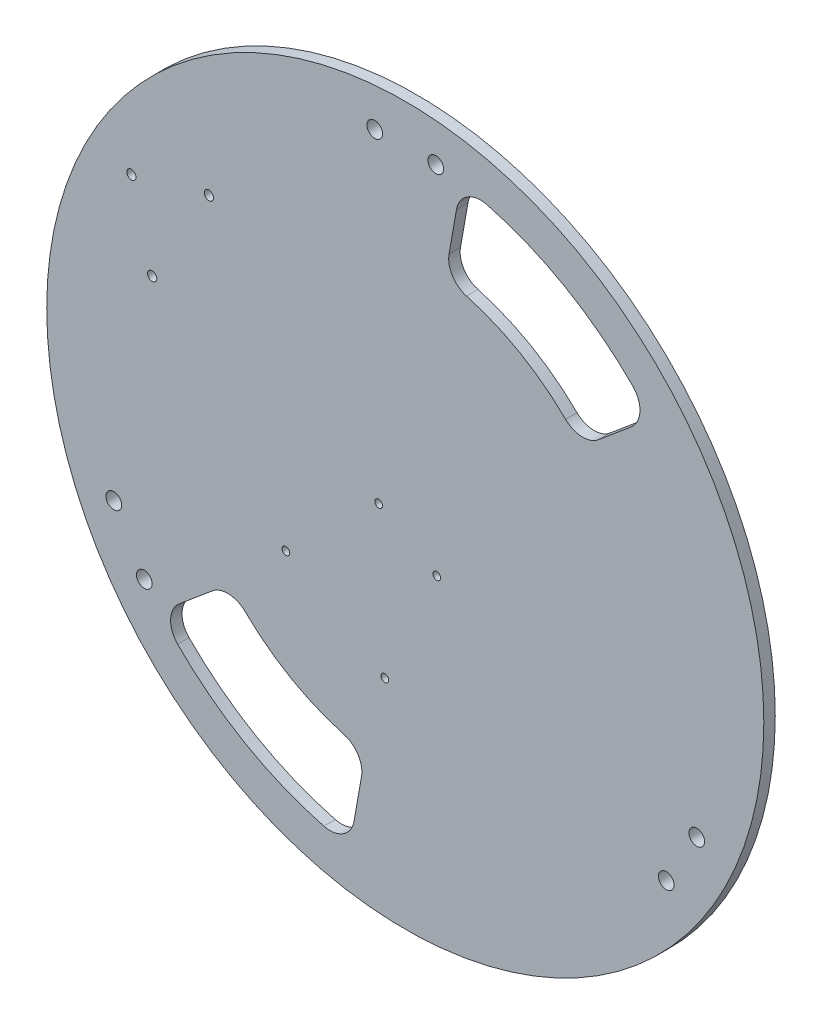
ISO-10303-21;
HEADER;
FILE_DESCRIPTION(('STEP AP214'),'2;1');
FILE_NAME('part.step','',(''),(''),'','','');
FILE_SCHEMA(('AUTOMOTIVE_DESIGN { 1 0 10303 214 1 1 1 1 }'));
ENDSEC;
DATA;
#1=APPLICATION_CONTEXT('core data for automotive mechanical design processes');
#2=APPLICATION_PROTOCOL_DEFINITION('international standard','automotive_design',2000,#1);
#3=PRODUCT_CONTEXT('',#1,'mechanical');
#4=PRODUCT('Part','Part','',(#3));
#5=PRODUCT_RELATED_PRODUCT_CATEGORY('part','',(#4));
#6=PRODUCT_DEFINITION_FORMATION('','',#4);
#7=PRODUCT_DEFINITION_CONTEXT('part definition',#1,'design');
#8=PRODUCT_DEFINITION('design','',#6,#7);
#9=PRODUCT_DEFINITION_SHAPE('','',#8);
#10=(LENGTH_UNIT() NAMED_UNIT(*) SI_UNIT(.MILLI.,.METRE.));
#11=(NAMED_UNIT(*) PLANE_ANGLE_UNIT() SI_UNIT($,.RADIAN.));
#12=(NAMED_UNIT(*) SI_UNIT($,.STERADIAN.) SOLID_ANGLE_UNIT());
#13=UNCERTAINTY_MEASURE_WITH_UNIT(LENGTH_MEASURE(1.E-05),#10,'distance_accuracy_value','');
#14=(GEOMETRIC_REPRESENTATION_CONTEXT(3) GLOBAL_UNCERTAINTY_ASSIGNED_CONTEXT((#13)) GLOBAL_UNIT_ASSIGNED_CONTEXT((#10,
#11,#12)) REPRESENTATION_CONTEXT('',''));
#15=CARTESIAN_POINT('',(0.,0.,0.));
#16=DIRECTION('',(0.,0.,1.));
#17=DIRECTION('',(1.,0.,0.));
#18=AXIS2_PLACEMENT_3D('',#15,#16,#17);
#19=CARTESIAN_POINT('',(0.,0.,4.762));
#20=DIRECTION('',(0.,0.,-1.));
#21=DIRECTION('',(-1.,0.,0.));
#22=AXIS2_PLACEMENT_3D('',#19,#20,#21);
#23=CYLINDRICAL_SURFACE('',#22,149.225);
#24=CARTESIAN_POINT('',(0.,0.,4.762));
#25=DIRECTION('',(0.,0.,1.));
#26=DIRECTION('',(1.,0.,0.));
#27=AXIS2_PLACEMENT_3D('',#24,#25,#26);
#28=CIRCLE('',#27,149.225);
#29=CARTESIAN_POINT('',(149.225,0.,4.762));
#30=VERTEX_POINT('',#29);
#31=EDGE_CURVE('E12',#30,#30,#28,.T.);
#32=ORIENTED_EDGE('',*,*,#31,.F.);
#33=EDGE_LOOP('',(#32));
#34=FACE_BOUND('',#33,.T.);
#35=CARTESIAN_POINT('',(0.,0.,0.));
#36=DIRECTION('',(0.,0.,1.));
#37=DIRECTION('',(1.,0.,0.));
#38=AXIS2_PLACEMENT_3D('',#35,#36,#37);
#39=CIRCLE('',#38,149.225);
#40=CARTESIAN_POINT('',(149.225,0.,0.));
#41=VERTEX_POINT('',#40);
#42=EDGE_CURVE('E47',#41,#41,#39,.T.);
#43=ORIENTED_EDGE('',*,*,#42,.T.);
#44=EDGE_LOOP('',(#43));
#45=FACE_BOUND('',#44,.T.);
#46=ADVANCED_FACE('F44',(#34,#45),#23,.T.);
#47=CARTESIAN_POINT('',(0.,0.,4.762));
#48=DIRECTION('',(0.,0.,1.));
#49=DIRECTION('',(1.,0.,0.));
#50=AXIS2_PLACEMENT_3D('',#47,#48,#49);
#51=PLANE('',#50);
#52=CARTESIAN_POINT('',(-73.8420625200768,-75.2237854855835,4.762));
#53=DIRECTION('',(0.,0.,1.));
#54=DIRECTION('',(-1.,0.,0.));
#55=AXIS2_PLACEMENT_3D('',#52,#53,#54);
#56=CIRCLE('',#55,10.16);
#57=CARTESIAN_POINT('',(-66.724755289226,-67.9733001375755,4.762));
#58=VERTEX_POINT('',#57);
#59=CARTESIAN_POINT('',(-80.3727846344921,-67.4407739434947,4.762));
#60=VERTEX_POINT('',#59);
#61=EDGE_CURVE('E59',#58,#60,#56,.T.);
#62=ORIENTED_EDGE('',*,*,#61,.F.);
#63=CARTESIAN_POINT('',(0.,0.,4.762));
#64=DIRECTION('',(0.,0.,-1.));
#65=DIRECTION('',(-1.,0.,0.));
#66=AXIS2_PLACEMENT_3D('',#63,#64,#65);
#67=CIRCLE('',#66,95.25);
#68=CARTESIAN_POINT('',(-25.5042270535908,-91.7719832105577,4.762));
#69=VERTEX_POINT('',#68);
#70=EDGE_CURVE('E176',#69,#58,#67,.T.);
#71=ORIENTED_EDGE('',*,*,#70,.F.);
#72=CARTESIAN_POINT('',(-28.2246779393071,-101.560994753017,4.762));
#73=DIRECTION('',(0.,0.,1.));
#74=DIRECTION('',(1.,0.,0.));
#75=AXIS2_PLACEMENT_3D('',#72,#73,#74);
#76=CIRCLE('',#75,10.16);
#77=CARTESIAN_POINT('',(-18.2190311687031,-103.325260238113,4.762));
#78=VERTEX_POINT('',#77);
#79=EDGE_CURVE('E179',#78,#69,#76,.T.);
#80=ORIENTED_EDGE('',*,*,#79,.F.);
#81=DIRECTION('',(0.173648177666932,0.984807753012208,0.));
#82=VECTOR('',#81,1.);
#83=CARTESIAN_POINT('',(-21.3188416515423,-120.905159073699,4.762));
#84=LINE('',#83,#82);
#85=CARTESIAN_POINT('',(-21.3188416515423,-120.905159073699,4.762));
#86=VERTEX_POINT('',#85);
#87=EDGE_CURVE('E207',#86,#78,#84,.T.);
#88=ORIENTED_EDGE('',*,*,#87,.F.);
#89=CARTESIAN_POINT('',(-31.3244884221463,-119.140893588603,4.762));
#90=DIRECTION('',(0.,0.,1.));
#91=DIRECTION('',(-1.,0.,0.));
#92=AXIS2_PLACEMENT_3D('',#89,#90,#91);
#93=CIRCLE('',#92,10.1599999999999);
#94=CARTESIAN_POINT('',(-33.9079513847975,-128.966946668075,4.762));
#95=VERTEX_POINT('',#94);
#96=EDGE_CURVE('E204',#95,#86,#93,.T.);
#97=ORIENTED_EDGE('',*,*,#96,.F.);
#98=CARTESIAN_POINT('',(0.,0.,4.762));
#99=DIRECTION('',(0.,0.,1.));
#100=DIRECTION('',(-1.,0.,0.));
#101=AXIS2_PLACEMENT_3D('',#98,#99,#100);
#102=CIRCLE('',#101,133.35);
#103=CARTESIAN_POINT('',(-94.7346763706666,-93.8486206235609,4.762));
#104=VERTEX_POINT('',#103);
#105=EDGE_CURVE('E201',#104,#95,#102,.T.);
#106=ORIENTED_EDGE('',*,*,#105,.F.);
#107=CARTESIAN_POINT('',(-87.5167962662349,-86.6982495284325,4.762));
#108=DIRECTION('',(0.,0.,1.));
#109=DIRECTION('',(1.,0.,0.));
#110=AXIS2_PLACEMENT_3D('',#107,#108,#109);
#111=CIRCLE('',#110,10.1599999999999);
#112=CARTESIAN_POINT('',(-94.0475183806502,-78.9152379863437,4.762));
#113=VERTEX_POINT('',#112);
#114=EDGE_CURVE('E198',#113,#104,#111,.T.);
#115=ORIENTED_EDGE('',*,*,#114,.F.);
#116=DIRECTION('',(-0.766044443118972,-0.642787609686547,0.));
#117=VECTOR('',#116,1.);
#118=CARTESIAN_POINT('',(-94.0475183806502,-78.9152379863437,4.762));
#119=LINE('',#118,#117);
#120=EDGE_CURVE('E196',#60,#113,#119,.T.);
#121=ORIENTED_EDGE('',*,*,#120,.F.);
#122=EDGE_LOOP('',(#62,#71,#80,#88,#97,#106,#115,#121));
#123=FACE_BOUND('',#122,.T.);
#124=CARTESIAN_POINT('',(87.5167962662342,86.6982495284331,4.762));
#125=DIRECTION('',(0.,0.,1.));
#126=DIRECTION('',(1.,0.,0.));
#127=AXIS2_PLACEMENT_3D('',#124,#125,#126);
#128=CIRCLE('',#127,10.1599999999999);
#129=CARTESIAN_POINT('',(94.0475183806496,78.9152379863444,4.762));
#130=VERTEX_POINT('',#129);
#131=CARTESIAN_POINT('',(94.7346763706658,93.8486206235615,4.762));
#132=VERTEX_POINT('',#131);
#133=EDGE_CURVE('E214',#130,#132,#128,.T.);
#134=ORIENTED_EDGE('',*,*,#133,.F.);
#135=DIRECTION('',(0.766044443118967,0.642787609686552,0.));
#136=VECTOR('',#135,1.);
#137=CARTESIAN_POINT('',(94.0475183806496,78.9152379863444,4.762));
#138=LINE('',#137,#136);
#139=CARTESIAN_POINT('',(80.3727846344916,67.4407739434953,4.762));
#140=VERTEX_POINT('',#139);
#141=EDGE_CURVE('E230',#140,#130,#138,.T.);
#142=ORIENTED_EDGE('',*,*,#141,.F.);
#143=CARTESIAN_POINT('',(73.8420625200762,75.223785485584,4.762));
#144=DIRECTION('',(0.,0.,1.));
#145=DIRECTION('',(-1.,0.,0.));
#146=AXIS2_PLACEMENT_3D('',#143,#144,#145);
#147=CIRCLE('',#146,10.16);
#148=CARTESIAN_POINT('',(66.7247552892255,67.9733001375759,4.762));
#149=VERTEX_POINT('',#148);
#150=EDGE_CURVE('E268',#149,#140,#147,.T.);
#151=ORIENTED_EDGE('',*,*,#150,.F.);
#152=CARTESIAN_POINT('',(0.,0.,4.762));
#153=DIRECTION('',(0.,0.,-1.));
#154=DIRECTION('',(1.,0.,0.));
#155=AXIS2_PLACEMENT_3D('',#152,#153,#154);
#156=CIRCLE('',#155,95.25);
#157=CARTESIAN_POINT('',(25.5042270535901,91.7719832105579,4.762));
#158=VERTEX_POINT('',#157);
#159=EDGE_CURVE('E265',#158,#149,#156,.T.);
#160=ORIENTED_EDGE('',*,*,#159,.F.);
#161=CARTESIAN_POINT('',(28.2246779393064,101.560994753017,4.762));
#162=DIRECTION('',(0.,0.,1.));
#163=DIRECTION('',(1.,0.,0.));
#164=AXIS2_PLACEMENT_3D('',#161,#162,#163);
#165=CIRCLE('',#164,10.16);
#166=CARTESIAN_POINT('',(18.2190311687024,103.325260238113,4.762));
#167=VERTEX_POINT('',#166);
#168=EDGE_CURVE('E262',#167,#158,#165,.T.);
#169=ORIENTED_EDGE('',*,*,#168,.F.);
#170=DIRECTION('',(-0.173648177666925,-0.984807753012209,0.));
#171=VECTOR('',#170,1.);
#172=CARTESIAN_POINT('',(21.3188416515413,120.905159073699,4.762));
#173=LINE('',#172,#171);
#174=CARTESIAN_POINT('',(21.3188416515413,120.905159073699,4.762));
#175=VERTEX_POINT('',#174);
#176=EDGE_CURVE('E259',#175,#167,#173,.T.);
#177=ORIENTED_EDGE('',*,*,#176,.F.);
#178=CARTESIAN_POINT('',(31.3244884221454,119.140893588603,4.762));
#179=DIRECTION('',(0.,0.,1.));
#180=DIRECTION('',(-1.,0.,0.));
#181=AXIS2_PLACEMENT_3D('',#178,#179,#180);
#182=CIRCLE('',#181,10.1599999999999);
#183=CARTESIAN_POINT('',(33.9079513847965,128.966946668076,4.762));
#184=VERTEX_POINT('',#183);
#185=EDGE_CURVE('E256',#184,#175,#182,.T.);
#186=ORIENTED_EDGE('',*,*,#185,.F.);
#187=CARTESIAN_POINT('',(0.,0.,4.762));
#188=DIRECTION('',(0.,0.,1.));
#189=DIRECTION('',(1.,0.,0.));
#190=AXIS2_PLACEMENT_3D('',#187,#188,#189);
#191=CIRCLE('',#190,133.35);
#192=EDGE_CURVE('E253',#132,#184,#191,.T.);
#193=ORIENTED_EDGE('',*,*,#192,.F.);
#194=EDGE_LOOP('',(#134,#142,#151,#160,#169,#177,#186,#193));
#195=FACE_BOUND('',#194,.T.);
#196=CARTESIAN_POINT('',(12.7000000000009,132.74386049833,4.762));
#197=DIRECTION('',(0.,0.,1.));
#198=DIRECTION('',(-1.,0.,0.));
#199=AXIS2_PLACEMENT_3D('',#196,#197,#198);
#200=CIRCLE('',#199,3.2639);
#201=CARTESIAN_POINT('',(9.43610000000086,132.74386049833,4.762));
#202=VERTEX_POINT('',#201);
#203=EDGE_CURVE('E275',#202,#202,#200,.T.);
#204=ORIENTED_EDGE('',*,*,#203,.F.);
#205=EDGE_LOOP('',(#204));
#206=FACE_BOUND('',#205,.T.);
#207=CARTESIAN_POINT('',(-12.6999999999991,132.74386049833,4.762));
#208=DIRECTION('',(0.,0.,1.));
#209=DIRECTION('',(1.,0.,0.));
#210=AXIS2_PLACEMENT_3D('',#207,#208,#209);
#211=CIRCLE('',#210,3.26390000000004);
#212=CARTESIAN_POINT('',(-9.43609999999907,132.74386049833,4.762));
#213=VERTEX_POINT('',#212);
#214=EDGE_CURVE('E293',#213,#213,#211,.T.);
#215=ORIENTED_EDGE('',*,*,#214,.F.);
#216=EDGE_LOOP('',(#215));
#217=FACE_BOUND('',#216,.T.);
#218=CARTESIAN_POINT('',(-121.309555387971,-55.3734076211022,4.762));
#219=DIRECTION('',(0.,0.,1.));
#220=DIRECTION('',(-1.,0.,0.));
#221=AXIS2_PLACEMENT_3D('',#218,#219,#220);
#222=CIRCLE('',#221,3.2639);
#223=CARTESIAN_POINT('',(-124.573455387971,-55.3734076211022,4.762));
#224=VERTEX_POINT('',#223);
#225=EDGE_CURVE('E299',#224,#224,#222,.T.);
#226=ORIENTED_EDGE('',*,*,#225,.F.);
#227=EDGE_LOOP('',(#226));
#228=FACE_BOUND('',#227,.T.);
#229=CARTESIAN_POINT('',(-108.609555387971,-77.3704528772269,4.762));
#230=DIRECTION('',(0.,0.,1.));
#231=DIRECTION('',(1.,0.,0.));
#232=AXIS2_PLACEMENT_3D('',#229,#230,#231);
#233=CIRCLE('',#232,3.26390000000003);
#234=CARTESIAN_POINT('',(-105.345655387971,-77.3704528772269,4.762));
#235=VERTEX_POINT('',#234);
#236=EDGE_CURVE('E305',#235,#235,#233,.T.);
#237=ORIENTED_EDGE('',*,*,#236,.F.);
#238=EDGE_LOOP('',(#237));
#239=FACE_BOUND('',#238,.T.);
#240=CARTESIAN_POINT('',(108.609555387971,-77.3704528772269,4.762));
#241=DIRECTION('',(0.,0.,1.));
#242=DIRECTION('',(-1.,0.,0.));
#243=AXIS2_PLACEMENT_3D('',#240,#241,#242);
#244=CIRCLE('',#243,3.26389999999999);
#245=CARTESIAN_POINT('',(105.345655387971,-77.3704528772269,4.762));
#246=VERTEX_POINT('',#245);
#247=EDGE_CURVE('E311',#246,#246,#244,.T.);
#248=ORIENTED_EDGE('',*,*,#247,.F.);
#249=EDGE_LOOP('',(#248));
#250=FACE_BOUND('',#249,.T.);
#251=CARTESIAN_POINT('',(121.309555387971,-55.3734076211021,4.762));
#252=DIRECTION('',(0.,0.,1.));
#253=DIRECTION('',(1.,0.,0.));
#254=AXIS2_PLACEMENT_3D('',#251,#252,#253);
#255=CIRCLE('',#254,3.26390000000002);
#256=CARTESIAN_POINT('',(124.573455387971,-55.3734076211021,4.762));
#257=VERTEX_POINT('',#256);
#258=EDGE_CURVE('E317',#257,#257,#255,.T.);
#259=ORIENTED_EDGE('',*,*,#258,.F.);
#260=EDGE_LOOP('',(#259));
#261=FACE_BOUND('',#260,.T.);
#262=CARTESIAN_POINT('',(-49.6807000225601,-37.6815093946631,4.762));
#263=DIRECTION('',(0.,0.,-1.));
#264=DIRECTION('',(-1.,0.,0.));
#265=AXIS2_PLACEMENT_3D('',#262,#263,#264);
#266=CIRCLE('',#265,1.58749999999997);
#267=CARTESIAN_POINT('',(-51.2682000225601,-37.6815093946631,4.762));
#268=VERTEX_POINT('',#267);
#269=EDGE_CURVE('E323',#268,#268,#266,.T.);
#270=ORIENTED_EDGE('',*,*,#269,.T.);
#271=EDGE_LOOP('',(#270));
#272=FACE_BOUND('',#271,.T.);
#273=CARTESIAN_POINT('',(-11.0824728688855,-1.30741888241334,4.762));
#274=DIRECTION('',(0.,0.,-1.));
#275=DIRECTION('',(-1.,0.,0.));
#276=AXIS2_PLACEMENT_3D('',#273,#274,#275);
#277=CIRCLE('',#276,1.5875);
#278=CARTESIAN_POINT('',(-12.6699728688855,-1.30741888241334,4.762));
#279=VERTEX_POINT('',#278);
#280=EDGE_CURVE('E330',#279,#279,#277,.T.);
#281=ORIENTED_EDGE('',*,*,#280,.T.);
#282=EDGE_LOOP('',(#281));
#283=FACE_BOUND('',#282,.T.);
#284=CARTESIAN_POINT('',(-8.52131403592293,-62.9113616574691,4.762));
#285=DIRECTION('',(0.,0.,-1.));
#286=DIRECTION('',(-1.,0.,0.));
#287=AXIS2_PLACEMENT_3D('',#284,#285,#286);
#288=CIRCLE('',#287,1.5875);
#289=CARTESIAN_POINT('',(-10.1088140359229,-62.9113616574691,4.762));
#290=VERTEX_POINT('',#289);
#291=EDGE_CURVE('E337',#290,#290,#288,.T.);
#292=ORIENTED_EDGE('',*,*,#291,.T.);
#293=EDGE_LOOP('',(#292));
#294=FACE_BOUND('',#293,.T.);
#295=CARTESIAN_POINT('',(13.1142769128518,-15.2774188824132,4.762));
#296=DIRECTION('',(0.,0.,-1.));
#297=DIRECTION('',(-1.,0.,0.));
#298=AXIS2_PLACEMENT_3D('',#295,#296,#297);
#299=CIRCLE('',#298,1.58750000000002);
#300=CARTESIAN_POINT('',(11.5267769128518,-15.2774188824132,4.762));
#301=VERTEX_POINT('',#300);
#302=EDGE_CURVE('E346',#301,#301,#299,.T.);
#303=ORIENTED_EDGE('',*,*,#302,.T.);
#304=EDGE_LOOP('',(#303));
#305=FACE_BOUND('',#304,.T.);
#306=CARTESIAN_POINT('',(-105.341743632103,33.542747925304,4.762));
#307=DIRECTION('',(0.,0.,1.));
#308=DIRECTION('',(1.,0.,0.));
#309=AXIS2_PLACEMENT_3D('',#306,#307,#308);
#310=CIRCLE('',#309,1.9266495952984);
#311=CARTESIAN_POINT('',(-103.415094036804,33.542747925304,4.762));
#312=VERTEX_POINT('',#311);
#313=EDGE_CURVE('E349',#312,#312,#310,.T.);
#314=ORIENTED_EDGE('',*,*,#313,.F.);
#315=EDGE_LOOP('',(#314));
#316=FACE_BOUND('',#315,.T.);
#317=CARTESIAN_POINT('',(-113.987995720298,65.8110000135002,4.762));
#318=DIRECTION('',(0.,0.,1.));
#319=DIRECTION('',(1.,0.,0.));
#320=AXIS2_PLACEMENT_3D('',#317,#318,#319);
#321=CIRCLE('',#320,1.9266495952984);
#322=CARTESIAN_POINT('',(-112.061346124999,65.8110000135002,4.762));
#323=VERTEX_POINT('',#322);
#324=EDGE_CURVE('E355',#323,#323,#321,.T.);
#325=ORIENTED_EDGE('',*,*,#324,.F.);
#326=EDGE_LOOP('',(#325));
#327=FACE_BOUND('',#326,.T.);
#328=CARTESIAN_POINT('',(-81.7197436321017,74.4572521016954,4.762));
#329=DIRECTION('',(0.,0.,1.));
#330=DIRECTION('',(1.,0.,0.));
#331=AXIS2_PLACEMENT_3D('',#328,#329,#330);
#332=CIRCLE('',#331,1.92664959529841);
#333=CARTESIAN_POINT('',(-79.7930940368033,74.4572521016954,4.762));
#334=VERTEX_POINT('',#333);
#335=EDGE_CURVE('E361',#334,#334,#332,.T.);
#336=ORIENTED_EDGE('',*,*,#335,.F.);
#337=EDGE_LOOP('',(#336));
#338=FACE_BOUND('',#337,.T.);
#339=ORIENTED_EDGE('',*,*,#31,.T.);
#340=EDGE_LOOP('',(#339));
#341=FACE_BOUND('',#340,.T.);
#342=ADVANCED_FACE('F372',(#123,#195,#206,#217,#228,#239,#250,#261,#272,#283,#294,#305,#316,
#327,#338,#341),#51,.T.);
#343=CARTESIAN_POINT('',(0.,0.,0.));
#344=DIRECTION('',(0.,0.,1.));
#345=DIRECTION('',(1.,0.,0.));
#346=AXIS2_PLACEMENT_3D('',#343,#344,#345);
#347=PLANE('',#346);
#348=CARTESIAN_POINT('',(0.,0.,0.));
#349=DIRECTION('',(0.,0.,-1.));
#350=DIRECTION('',(-1.,0.,0.));
#351=AXIS2_PLACEMENT_3D('',#348,#349,#350);
#352=CIRCLE('',#351,95.25);
#353=CARTESIAN_POINT('',(-25.5042270535908,-91.7719832105577,0.));
#354=VERTEX_POINT('',#353);
#355=CARTESIAN_POINT('',(-66.724755289226,-67.9733001375755,0.));
#356=VERTEX_POINT('',#355);
#357=EDGE_CURVE('E165',#354,#356,#352,.T.);
#358=ORIENTED_EDGE('',*,*,#357,.T.);
#359=CARTESIAN_POINT('',(-73.8420625200768,-75.2237854855835,0.));
#360=DIRECTION('',(0.,0.,1.));
#361=DIRECTION('',(-1.,0.,0.));
#362=AXIS2_PLACEMENT_3D('',#359,#360,#361);
#363=CIRCLE('',#362,10.16);
#364=CARTESIAN_POINT('',(-80.3727846344921,-67.4407739434947,0.));
#365=VERTEX_POINT('',#364);
#366=EDGE_CURVE('E159',#356,#365,#363,.T.);
#367=ORIENTED_EDGE('',*,*,#366,.T.);
#368=DIRECTION('',(-0.766044443118972,-0.642787609686547,0.));
#369=VECTOR('',#368,1.);
#370=CARTESIAN_POINT('',(-94.0475183806502,-78.9152379863437,0.));
#371=LINE('',#370,#369);
#372=CARTESIAN_POINT('',(-94.0475183806502,-78.9152379863437,0.));
#373=VERTEX_POINT('',#372);
#374=EDGE_CURVE('E168',#365,#373,#371,.T.);
#375=ORIENTED_EDGE('',*,*,#374,.T.);
#376=CARTESIAN_POINT('',(-87.5167962662349,-86.6982495284325,0.));
#377=DIRECTION('',(0.,0.,1.));
#378=DIRECTION('',(1.,0.,0.));
#379=AXIS2_PLACEMENT_3D('',#376,#377,#378);
#380=CIRCLE('',#379,10.1599999999999);
#381=CARTESIAN_POINT('',(-94.7346763706666,-93.8486206235609,0.));
#382=VERTEX_POINT('',#381);
#383=EDGE_CURVE('E67',#373,#382,#380,.T.);
#384=ORIENTED_EDGE('',*,*,#383,.T.);
#385=CARTESIAN_POINT('',(0.,0.,0.));
#386=DIRECTION('',(0.,0.,1.));
#387=DIRECTION('',(-1.,0.,0.));
#388=AXIS2_PLACEMENT_3D('',#385,#386,#387);
#389=CIRCLE('',#388,133.35);
#390=CARTESIAN_POINT('',(-33.9079513847975,-128.966946668075,0.));
#391=VERTEX_POINT('',#390);
#392=EDGE_CURVE('E183',#382,#391,#389,.T.);
#393=ORIENTED_EDGE('',*,*,#392,.T.);
#394=CARTESIAN_POINT('',(-31.3244884221463,-119.140893588603,0.));
#395=DIRECTION('',(0.,0.,1.));
#396=DIRECTION('',(-1.,0.,0.));
#397=AXIS2_PLACEMENT_3D('',#394,#395,#396);
#398=CIRCLE('',#397,10.1599999999999);
#399=CARTESIAN_POINT('',(-21.3188416515423,-120.905159073699,0.));
#400=VERTEX_POINT('',#399);
#401=EDGE_CURVE('E186',#391,#400,#398,.T.);
#402=ORIENTED_EDGE('',*,*,#401,.T.);
#403=DIRECTION('',(0.173648177666932,0.984807753012208,0.));
#404=VECTOR('',#403,1.);
#405=CARTESIAN_POINT('',(-21.3188416515423,-120.905159073699,0.));
#406=LINE('',#405,#404);
#407=CARTESIAN_POINT('',(-18.2190311687031,-103.325260238113,0.));
#408=VERTEX_POINT('',#407);
#409=EDGE_CURVE('E189',#400,#408,#406,.T.);
#410=ORIENTED_EDGE('',*,*,#409,.T.);
#411=CARTESIAN_POINT('',(-28.2246779393071,-101.560994753017,0.));
#412=DIRECTION('',(0.,0.,1.));
#413=DIRECTION('',(1.,0.,0.));
#414=AXIS2_PLACEMENT_3D('',#411,#412,#413);
#415=CIRCLE('',#414,10.16);
#416=EDGE_CURVE('E192',#408,#354,#415,.T.);
#417=ORIENTED_EDGE('',*,*,#416,.T.);
#418=EDGE_LOOP('',(#358,#367,#375,#384,#393,#402,#410,#417));
#419=FACE_BOUND('',#418,.T.);
#420=DIRECTION('',(0.766044443118967,0.642787609686552,0.));
#421=VECTOR('',#420,1.);
#422=CARTESIAN_POINT('',(94.0475183806496,78.9152379863444,0.));
#423=LINE('',#422,#421);
#424=CARTESIAN_POINT('',(80.3727846344916,67.4407739434953,0.));
#425=VERTEX_POINT('',#424);
#426=CARTESIAN_POINT('',(94.0475183806496,78.9152379863444,0.));
#427=VERTEX_POINT('',#426);
#428=EDGE_CURVE('E248',#425,#427,#423,.T.);
#429=ORIENTED_EDGE('',*,*,#428,.T.);
#430=CARTESIAN_POINT('',(87.5167962662342,86.6982495284331,0.));
#431=DIRECTION('',(0.,0.,1.));
#432=DIRECTION('',(1.,0.,0.));
#433=AXIS2_PLACEMENT_3D('',#430,#431,#432);
#434=CIRCLE('',#433,10.1599999999999);
#435=CARTESIAN_POINT('',(94.7346763706658,93.8486206235615,0.));
#436=VERTEX_POINT('',#435);
#437=EDGE_CURVE('E226',#427,#436,#434,.T.);
#438=ORIENTED_EDGE('',*,*,#437,.T.);
#439=CARTESIAN_POINT('',(0.,0.,0.));
#440=DIRECTION('',(0.,0.,1.));
#441=DIRECTION('',(1.,0.,0.));
#442=AXIS2_PLACEMENT_3D('',#439,#440,#441);
#443=CIRCLE('',#442,133.35);
#444=CARTESIAN_POINT('',(33.9079513847965,128.966946668076,0.));
#445=VERTEX_POINT('',#444);
#446=EDGE_CURVE('E229',#436,#445,#443,.T.);
#447=ORIENTED_EDGE('',*,*,#446,.T.);
#448=CARTESIAN_POINT('',(31.3244884221454,119.140893588603,0.));
#449=DIRECTION('',(0.,0.,1.));
#450=DIRECTION('',(-1.,0.,0.));
#451=AXIS2_PLACEMENT_3D('',#448,#449,#450);
#452=CIRCLE('',#451,10.1599999999999);
#453=CARTESIAN_POINT('',(21.3188416515413,120.905159073699,0.));
#454=VERTEX_POINT('',#453);
#455=EDGE_CURVE('E233',#445,#454,#452,.T.);
#456=ORIENTED_EDGE('',*,*,#455,.T.);
#457=DIRECTION('',(-0.173648177666925,-0.984807753012209,0.));
#458=VECTOR('',#457,1.);
#459=CARTESIAN_POINT('',(21.3188416515413,120.905159073699,0.));
#460=LINE('',#459,#458);
#461=CARTESIAN_POINT('',(18.2190311687024,103.325260238113,0.));
#462=VERTEX_POINT('',#461);
#463=EDGE_CURVE('E236',#454,#462,#460,.T.);
#464=ORIENTED_EDGE('',*,*,#463,.T.);
#465=CARTESIAN_POINT('',(28.2246779393064,101.560994753017,0.));
#466=DIRECTION('',(0.,0.,1.));
#467=DIRECTION('',(1.,0.,0.));
#468=AXIS2_PLACEMENT_3D('',#465,#466,#467);
#469=CIRCLE('',#468,10.16);
#470=CARTESIAN_POINT('',(25.5042270535901,91.7719832105579,0.));
#471=VERTEX_POINT('',#470);
#472=EDGE_CURVE('E239',#462,#471,#469,.T.);
#473=ORIENTED_EDGE('',*,*,#472,.T.);
#474=CARTESIAN_POINT('',(0.,0.,0.));
#475=DIRECTION('',(0.,0.,-1.));
#476=DIRECTION('',(1.,0.,0.));
#477=AXIS2_PLACEMENT_3D('',#474,#475,#476);
#478=CIRCLE('',#477,95.25);
#479=CARTESIAN_POINT('',(66.7247552892255,67.9733001375759,0.));
#480=VERTEX_POINT('',#479);
#481=EDGE_CURVE('E242',#471,#480,#478,.T.);
#482=ORIENTED_EDGE('',*,*,#481,.T.);
#483=CARTESIAN_POINT('',(73.8420625200762,75.223785485584,0.));
#484=DIRECTION('',(0.,0.,1.));
#485=DIRECTION('',(-1.,0.,0.));
#486=AXIS2_PLACEMENT_3D('',#483,#484,#485);
#487=CIRCLE('',#486,10.16);
#488=EDGE_CURVE('E245',#480,#425,#487,.T.);
#489=ORIENTED_EDGE('',*,*,#488,.T.);
#490=EDGE_LOOP('',(#429,#438,#447,#456,#464,#473,#482,#489));
#491=FACE_BOUND('',#490,.T.);
#492=CARTESIAN_POINT('',(12.7000000000009,132.74386049833,0.));
#493=DIRECTION('',(0.,0.,1.));
#494=DIRECTION('',(-1.,0.,0.));
#495=AXIS2_PLACEMENT_3D('',#492,#493,#494);
#496=CIRCLE('',#495,3.2639);
#497=CARTESIAN_POINT('',(9.43610000000086,132.74386049833,0.));
#498=VERTEX_POINT('',#497);
#499=EDGE_CURVE('E290',#498,#498,#496,.T.);
#500=ORIENTED_EDGE('',*,*,#499,.T.);
#501=EDGE_LOOP('',(#500));
#502=FACE_BOUND('',#501,.T.);
#503=CARTESIAN_POINT('',(-12.6999999999991,132.74386049833,0.));
#504=DIRECTION('',(0.,0.,1.));
#505=DIRECTION('',(1.,0.,0.));
#506=AXIS2_PLACEMENT_3D('',#503,#504,#505);
#507=CIRCLE('',#506,3.26390000000004);
#508=CARTESIAN_POINT('',(-9.43609999999907,132.74386049833,0.));
#509=VERTEX_POINT('',#508);
#510=EDGE_CURVE('E296',#509,#509,#507,.T.);
#511=ORIENTED_EDGE('',*,*,#510,.T.);
#512=EDGE_LOOP('',(#511));
#513=FACE_BOUND('',#512,.T.);
#514=CARTESIAN_POINT('',(-121.309555387971,-55.3734076211022,0.));
#515=DIRECTION('',(0.,0.,1.));
#516=DIRECTION('',(-1.,0.,0.));
#517=AXIS2_PLACEMENT_3D('',#514,#515,#516);
#518=CIRCLE('',#517,3.2639);
#519=CARTESIAN_POINT('',(-124.573455387971,-55.3734076211022,0.));
#520=VERTEX_POINT('',#519);
#521=EDGE_CURVE('E302',#520,#520,#518,.T.);
#522=ORIENTED_EDGE('',*,*,#521,.T.);
#523=EDGE_LOOP('',(#522));
#524=FACE_BOUND('',#523,.T.);
#525=CARTESIAN_POINT('',(-108.609555387971,-77.3704528772269,0.));
#526=DIRECTION('',(0.,0.,1.));
#527=DIRECTION('',(1.,0.,0.));
#528=AXIS2_PLACEMENT_3D('',#525,#526,#527);
#529=CIRCLE('',#528,3.26390000000003);
#530=CARTESIAN_POINT('',(-105.345655387971,-77.3704528772269,0.));
#531=VERTEX_POINT('',#530);
#532=EDGE_CURVE('E308',#531,#531,#529,.T.);
#533=ORIENTED_EDGE('',*,*,#532,.T.);
#534=EDGE_LOOP('',(#533));
#535=FACE_BOUND('',#534,.T.);
#536=CARTESIAN_POINT('',(108.609555387971,-77.3704528772269,0.));
#537=DIRECTION('',(0.,0.,1.));
#538=DIRECTION('',(-1.,0.,0.));
#539=AXIS2_PLACEMENT_3D('',#536,#537,#538);
#540=CIRCLE('',#539,3.26389999999999);
#541=CARTESIAN_POINT('',(105.345655387971,-77.3704528772269,0.));
#542=VERTEX_POINT('',#541);
#543=EDGE_CURVE('E314',#542,#542,#540,.T.);
#544=ORIENTED_EDGE('',*,*,#543,.T.);
#545=EDGE_LOOP('',(#544));
#546=FACE_BOUND('',#545,.T.);
#547=CARTESIAN_POINT('',(121.309555387971,-55.3734076211021,0.));
#548=DIRECTION('',(0.,0.,1.));
#549=DIRECTION('',(1.,0.,0.));
#550=AXIS2_PLACEMENT_3D('',#547,#548,#549);
#551=CIRCLE('',#550,3.26390000000002);
#552=CARTESIAN_POINT('',(124.573455387971,-55.3734076211021,0.));
#553=VERTEX_POINT('',#552);
#554=EDGE_CURVE('E320',#553,#553,#551,.T.);
#555=ORIENTED_EDGE('',*,*,#554,.T.);
#556=EDGE_LOOP('',(#555));
#557=FACE_BOUND('',#556,.T.);
#558=CARTESIAN_POINT('',(-49.6807000225601,-37.6815093946631,0.));
#559=DIRECTION('',(0.,0.,-1.));
#560=DIRECTION('',(-1.,0.,0.));
#561=AXIS2_PLACEMENT_3D('',#558,#559,#560);
#562=CIRCLE('',#561,1.58749999999997);
#563=CARTESIAN_POINT('',(-51.2682000225601,-37.6815093946631,0.));
#564=VERTEX_POINT('',#563);
#565=EDGE_CURVE('E326',#564,#564,#562,.T.);
#566=ORIENTED_EDGE('',*,*,#565,.F.);
#567=EDGE_LOOP('',(#566));
#568=FACE_BOUND('',#567,.T.);
#569=CARTESIAN_POINT('',(-11.0824728688855,-1.30741888241334,0.));
#570=DIRECTION('',(0.,0.,-1.));
#571=DIRECTION('',(-1.,0.,0.));
#572=AXIS2_PLACEMENT_3D('',#569,#570,#571);
#573=CIRCLE('',#572,1.5875);
#574=CARTESIAN_POINT('',(-12.6699728688855,-1.30741888241334,0.));
#575=VERTEX_POINT('',#574);
#576=EDGE_CURVE('E334',#575,#575,#573,.T.);
#577=ORIENTED_EDGE('',*,*,#576,.F.);
#578=EDGE_LOOP('',(#577));
#579=FACE_BOUND('',#578,.T.);
#580=CARTESIAN_POINT('',(-8.52131403592293,-62.9113616574691,0.));
#581=DIRECTION('',(0.,0.,-1.));
#582=DIRECTION('',(-1.,0.,0.));
#583=AXIS2_PLACEMENT_3D('',#580,#581,#582);
#584=CIRCLE('',#583,1.5875);
#585=CARTESIAN_POINT('',(-10.1088140359229,-62.9113616574691,0.));
#586=VERTEX_POINT('',#585);
#587=EDGE_CURVE('E340',#586,#586,#584,.T.);
#588=ORIENTED_EDGE('',*,*,#587,.F.);
#589=EDGE_LOOP('',(#588));
#590=FACE_BOUND('',#589,.T.);
#591=CARTESIAN_POINT('',(13.1142769128518,-15.2774188824132,0.));
#592=DIRECTION('',(0.,0.,-1.));
#593=DIRECTION('',(-1.,0.,0.));
#594=AXIS2_PLACEMENT_3D('',#591,#592,#593);
#595=CIRCLE('',#594,1.58750000000002);
#596=CARTESIAN_POINT('',(11.5267769128518,-15.2774188824132,0.));
#597=VERTEX_POINT('',#596);
#598=EDGE_CURVE('E343',#597,#597,#595,.T.);
#599=ORIENTED_EDGE('',*,*,#598,.F.);
#600=EDGE_LOOP('',(#599));
#601=FACE_BOUND('',#600,.T.);
#602=CARTESIAN_POINT('',(-105.341743632103,33.542747925304,0.));
#603=DIRECTION('',(0.,0.,1.));
#604=DIRECTION('',(1.,0.,0.));
#605=AXIS2_PLACEMENT_3D('',#602,#603,#604);
#606=CIRCLE('',#605,1.9266495952984);
#607=CARTESIAN_POINT('',(-103.415094036804,33.542747925304,0.));
#608=VERTEX_POINT('',#607);
#609=EDGE_CURVE('E352',#608,#608,#606,.T.);
#610=ORIENTED_EDGE('',*,*,#609,.T.);
#611=EDGE_LOOP('',(#610));
#612=FACE_BOUND('',#611,.T.);
#613=CARTESIAN_POINT('',(-113.987995720298,65.8110000135002,0.));
#614=DIRECTION('',(0.,0.,1.));
#615=DIRECTION('',(1.,0.,0.));
#616=AXIS2_PLACEMENT_3D('',#613,#614,#615);
#617=CIRCLE('',#616,1.9266495952984);
#618=CARTESIAN_POINT('',(-112.061346124999,65.8110000135002,0.));
#619=VERTEX_POINT('',#618);
#620=EDGE_CURVE('E358',#619,#619,#617,.T.);
#621=ORIENTED_EDGE('',*,*,#620,.T.);
#622=EDGE_LOOP('',(#621));
#623=FACE_BOUND('',#622,.T.);
#624=CARTESIAN_POINT('',(-81.7197436321017,74.4572521016954,0.));
#625=DIRECTION('',(0.,0.,1.));
#626=DIRECTION('',(1.,0.,0.));
#627=AXIS2_PLACEMENT_3D('',#624,#625,#626);
#628=CIRCLE('',#627,1.92664959529841);
#629=CARTESIAN_POINT('',(-79.7930940368033,74.4572521016954,0.));
#630=VERTEX_POINT('',#629);
#631=EDGE_CURVE('E364',#630,#630,#628,.T.);
#632=ORIENTED_EDGE('',*,*,#631,.T.);
#633=EDGE_LOOP('',(#632));
#634=FACE_BOUND('',#633,.T.);
#635=ORIENTED_EDGE('',*,*,#42,.F.);
#636=EDGE_LOOP('',(#635));
#637=FACE_BOUND('',#636,.T.);
#638=ADVANCED_FACE('F172',(#419,#491,#502,#513,#524,#535,#546,#557,#568,#579,#590,#601,#612,
#623,#634,#637),#347,.F.);
#639=CARTESIAN_POINT('',(-81.7197436321017,74.4572521016954,0.));
#640=DIRECTION('',(0.,0.,1.));
#641=DIRECTION('',(1.,0.,0.));
#642=AXIS2_PLACEMENT_3D('',#639,#640,#641);
#643=CYLINDRICAL_SURFACE('',#642,1.92664959529841);
#644=ORIENTED_EDGE('',*,*,#631,.F.);
#645=EDGE_LOOP('',(#644));
#646=FACE_BOUND('',#645,.T.);
#647=ORIENTED_EDGE('',*,*,#335,.T.);
#648=EDGE_LOOP('',(#647));
#649=FACE_BOUND('',#648,.T.);
#650=ADVANCED_FACE('F370',(#646,#649),#643,.F.);
#651=CARTESIAN_POINT('',(-113.987995720298,65.8110000135002,0.));
#652=DIRECTION('',(0.,0.,1.));
#653=DIRECTION('',(1.,0.,0.));
#654=AXIS2_PLACEMENT_3D('',#651,#652,#653);
#655=CYLINDRICAL_SURFACE('',#654,1.9266495952984);
#656=ORIENTED_EDGE('',*,*,#620,.F.);
#657=EDGE_LOOP('',(#656));
#658=FACE_BOUND('',#657,.T.);
#659=ORIENTED_EDGE('',*,*,#324,.T.);
#660=EDGE_LOOP('',(#659));
#661=FACE_BOUND('',#660,.T.);
#662=ADVANCED_FACE('F414',(#658,#661),#655,.F.);
#663=CARTESIAN_POINT('',(-105.341743632103,33.542747925304,0.));
#664=DIRECTION('',(0.,0.,1.));
#665=DIRECTION('',(1.,0.,0.));
#666=AXIS2_PLACEMENT_3D('',#663,#664,#665);
#667=CYLINDRICAL_SURFACE('',#666,1.9266495952984);
#668=ORIENTED_EDGE('',*,*,#609,.F.);
#669=EDGE_LOOP('',(#668));
#670=FACE_BOUND('',#669,.T.);
#671=ORIENTED_EDGE('',*,*,#313,.T.);
#672=EDGE_LOOP('',(#671));
#673=FACE_BOUND('',#672,.T.);
#674=ADVANCED_FACE('F422',(#670,#673),#667,.F.);
#675=CARTESIAN_POINT('',(13.1142769128518,-15.2774188824132,4.762));
#676=DIRECTION('',(0.,0.,-1.));
#677=DIRECTION('',(-1.,0.,0.));
#678=AXIS2_PLACEMENT_3D('',#675,#676,#677);
#679=CYLINDRICAL_SURFACE('',#678,1.58750000000002);
#680=ORIENTED_EDGE('',*,*,#302,.F.);
#681=EDGE_LOOP('',(#680));
#682=FACE_BOUND('',#681,.T.);
#683=ORIENTED_EDGE('',*,*,#598,.T.);
#684=EDGE_LOOP('',(#683));
#685=FACE_BOUND('',#684,.T.);
#686=ADVANCED_FACE('F430',(#682,#685),#679,.F.);
#687=CARTESIAN_POINT('',(-8.52131403592293,-62.9113616574691,4.762));
#688=DIRECTION('',(0.,0.,-1.));
#689=DIRECTION('',(-1.,0.,0.));
#690=AXIS2_PLACEMENT_3D('',#687,#688,#689);
#691=CYLINDRICAL_SURFACE('',#690,1.5875);
#692=ORIENTED_EDGE('',*,*,#291,.F.);
#693=EDGE_LOOP('',(#692));
#694=FACE_BOUND('',#693,.T.);
#695=ORIENTED_EDGE('',*,*,#587,.T.);
#696=EDGE_LOOP('',(#695));
#697=FACE_BOUND('',#696,.T.);
#698=ADVANCED_FACE('F438',(#694,#697),#691,.F.);
#699=CARTESIAN_POINT('',(-11.0824728688855,-1.30741888241334,4.762));
#700=DIRECTION('',(0.,0.,-1.));
#701=DIRECTION('',(-1.,0.,0.));
#702=AXIS2_PLACEMENT_3D('',#699,#700,#701);
#703=CYLINDRICAL_SURFACE('',#702,1.5875);
#704=ORIENTED_EDGE('',*,*,#280,.F.);
#705=EDGE_LOOP('',(#704));
#706=FACE_BOUND('',#705,.T.);
#707=ORIENTED_EDGE('',*,*,#576,.T.);
#708=EDGE_LOOP('',(#707));
#709=FACE_BOUND('',#708,.T.);
#710=ADVANCED_FACE('F446',(#706,#709),#703,.F.);
#711=CARTESIAN_POINT('',(-49.6807000225601,-37.6815093946631,4.762));
#712=DIRECTION('',(0.,0.,-1.));
#713=DIRECTION('',(-1.,0.,0.));
#714=AXIS2_PLACEMENT_3D('',#711,#712,#713);
#715=CYLINDRICAL_SURFACE('',#714,1.58749999999997);
#716=ORIENTED_EDGE('',*,*,#269,.F.);
#717=EDGE_LOOP('',(#716));
#718=FACE_BOUND('',#717,.T.);
#719=ORIENTED_EDGE('',*,*,#565,.T.);
#720=EDGE_LOOP('',(#719));
#721=FACE_BOUND('',#720,.T.);
#722=ADVANCED_FACE('F454',(#718,#721),#715,.F.);
#723=CARTESIAN_POINT('',(121.309555387971,-55.3734076211021,0.));
#724=DIRECTION('',(0.,0.,1.));
#725=DIRECTION('',(1.,0.,0.));
#726=AXIS2_PLACEMENT_3D('',#723,#724,#725);
#727=CYLINDRICAL_SURFACE('',#726,3.26390000000002);
#728=ORIENTED_EDGE('',*,*,#554,.F.);
#729=EDGE_LOOP('',(#728));
#730=FACE_BOUND('',#729,.T.);
#731=ORIENTED_EDGE('',*,*,#258,.T.);
#732=EDGE_LOOP('',(#731));
#733=FACE_BOUND('',#732,.T.);
#734=ADVANCED_FACE('F462',(#730,#733),#727,.F.);
#735=CARTESIAN_POINT('',(108.609555387971,-77.3704528772269,0.));
#736=DIRECTION('',(0.,0.,1.));
#737=DIRECTION('',(1.,0.,0.));
#738=AXIS2_PLACEMENT_3D('',#735,#736,#737);
#739=CYLINDRICAL_SURFACE('',#738,3.26389999999999);
#740=ORIENTED_EDGE('',*,*,#543,.F.);
#741=EDGE_LOOP('',(#740));
#742=FACE_BOUND('',#741,.T.);
#743=ORIENTED_EDGE('',*,*,#247,.T.);
#744=EDGE_LOOP('',(#743));
#745=FACE_BOUND('',#744,.T.);
#746=ADVANCED_FACE('F470',(#742,#745),#739,.F.);
#747=CARTESIAN_POINT('',(-108.609555387971,-77.3704528772269,0.));
#748=DIRECTION('',(0.,0.,1.));
#749=DIRECTION('',(1.,0.,0.));
#750=AXIS2_PLACEMENT_3D('',#747,#748,#749);
#751=CYLINDRICAL_SURFACE('',#750,3.26390000000003);
#752=ORIENTED_EDGE('',*,*,#532,.F.);
#753=EDGE_LOOP('',(#752));
#754=FACE_BOUND('',#753,.T.);
#755=ORIENTED_EDGE('',*,*,#236,.T.);
#756=EDGE_LOOP('',(#755));
#757=FACE_BOUND('',#756,.T.);
#758=ADVANCED_FACE('F478',(#754,#757),#751,.F.);
#759=CARTESIAN_POINT('',(-121.309555387971,-55.3734076211022,0.));
#760=DIRECTION('',(0.,0.,1.));
#761=DIRECTION('',(1.,0.,0.));
#762=AXIS2_PLACEMENT_3D('',#759,#760,#761);
#763=CYLINDRICAL_SURFACE('',#762,3.2639);
#764=ORIENTED_EDGE('',*,*,#521,.F.);
#765=EDGE_LOOP('',(#764));
#766=FACE_BOUND('',#765,.T.);
#767=ORIENTED_EDGE('',*,*,#225,.T.);
#768=EDGE_LOOP('',(#767));
#769=FACE_BOUND('',#768,.T.);
#770=ADVANCED_FACE('F486',(#766,#769),#763,.F.);
#771=CARTESIAN_POINT('',(-12.6999999999991,132.74386049833,0.));
#772=DIRECTION('',(0.,0.,1.));
#773=DIRECTION('',(1.,0.,0.));
#774=AXIS2_PLACEMENT_3D('',#771,#772,#773);
#775=CYLINDRICAL_SURFACE('',#774,3.26390000000004);
#776=ORIENTED_EDGE('',*,*,#510,.F.);
#777=EDGE_LOOP('',(#776));
#778=FACE_BOUND('',#777,.T.);
#779=ORIENTED_EDGE('',*,*,#214,.T.);
#780=EDGE_LOOP('',(#779));
#781=FACE_BOUND('',#780,.T.);
#782=ADVANCED_FACE('F494',(#778,#781),#775,.F.);
#783=CARTESIAN_POINT('',(12.7000000000009,132.74386049833,0.));
#784=DIRECTION('',(0.,0.,1.));
#785=DIRECTION('',(1.,0.,0.));
#786=AXIS2_PLACEMENT_3D('',#783,#784,#785);
#787=CYLINDRICAL_SURFACE('',#786,3.2639);
#788=ORIENTED_EDGE('',*,*,#499,.F.);
#789=EDGE_LOOP('',(#788));
#790=FACE_BOUND('',#789,.T.);
#791=ORIENTED_EDGE('',*,*,#203,.T.);
#792=EDGE_LOOP('',(#791));
#793=FACE_BOUND('',#792,.T.);
#794=ADVANCED_FACE('F502',(#790,#793),#787,.F.);
#795=CARTESIAN_POINT('',(87.5167962662342,86.6982495284331,0.));
#796=DIRECTION('',(0.,0.,1.));
#797=DIRECTION('',(1.,0.,0.));
#798=AXIS2_PLACEMENT_3D('',#795,#796,#797);
#799=CYLINDRICAL_SURFACE('',#798,10.1599999999999);
#800=ORIENTED_EDGE('',*,*,#133,.T.);
#801=DIRECTION('',(0.,0.,1.));
#802=VECTOR('',#801,1.);
#803=CARTESIAN_POINT('',(94.7346763706658,93.8486206235615,0.));
#804=LINE('',#803,#802);
#805=EDGE_CURVE('E251',#436,#132,#804,.T.);
#806=ORIENTED_EDGE('',*,*,#805,.F.);
#807=ORIENTED_EDGE('',*,*,#437,.F.);
#808=DIRECTION('',(0.,0.,1.));
#809=VECTOR('',#808,1.);
#810=CARTESIAN_POINT('',(94.0475183806496,78.9152379863444,0.));
#811=LINE('',#810,#809);
#812=EDGE_CURVE('E273',#427,#130,#811,.T.);
#813=ORIENTED_EDGE('',*,*,#812,.T.);
#814=EDGE_LOOP('',(#800,#806,#807,#813));
#815=FACE_BOUND('',#814,.T.);
#816=ADVANCED_FACE('F509',(#815),#799,.F.);
#817=CARTESIAN_POINT('',(94.0475183806496,78.9152379863444,0.));
#818=DIRECTION('',(0.642787609686552,-0.766044443118967,0.));
#819=DIRECTION('',(0.766044443118967,0.642787609686553,0.));
#820=AXIS2_PLACEMENT_3D('',#817,#818,#819);
#821=PLANE('',#820);
#822=ORIENTED_EDGE('',*,*,#141,.T.);
#823=ORIENTED_EDGE('',*,*,#812,.F.);
#824=ORIENTED_EDGE('',*,*,#428,.F.);
#825=DIRECTION('',(0.,0.,1.));
#826=VECTOR('',#825,1.);
#827=CARTESIAN_POINT('',(80.3727846344916,67.4407739434953,0.));
#828=LINE('',#827,#826);
#829=EDGE_CURVE('E276',#425,#140,#828,.T.);
#830=ORIENTED_EDGE('',*,*,#829,.T.);
#831=EDGE_LOOP('',(#822,#823,#824,#830));
#832=FACE_BOUND('',#831,.T.);
#833=ADVANCED_FACE('F516',(#832),#821,.F.);
#834=CARTESIAN_POINT('',(73.8420625200762,75.223785485584,0.));
#835=DIRECTION('',(0.,0.,1.));
#836=DIRECTION('',(1.,0.,0.));
#837=AXIS2_PLACEMENT_3D('',#834,#835,#836);
#838=CYLINDRICAL_SURFACE('',#837,10.16);
#839=ORIENTED_EDGE('',*,*,#150,.T.);
#840=ORIENTED_EDGE('',*,*,#829,.F.);
#841=ORIENTED_EDGE('',*,*,#488,.F.);
#842=DIRECTION('',(0.,0.,1.));
#843=VECTOR('',#842,1.);
#844=CARTESIAN_POINT('',(66.7247552892255,67.9733001375759,0.));
#845=LINE('',#844,#843);
#846=EDGE_CURVE('E278',#480,#149,#845,.T.);
#847=ORIENTED_EDGE('',*,*,#846,.T.);
#848=EDGE_LOOP('',(#839,#840,#841,#847));
#849=FACE_BOUND('',#848,.T.);
#850=ADVANCED_FACE('F524',(#849),#838,.F.);
#851=CARTESIAN_POINT('',(0.,0.,0.));
#852=DIRECTION('',(0.,0.,1.));
#853=DIRECTION('',(1.,0.,0.));
#854=AXIS2_PLACEMENT_3D('',#851,#852,#853);
#855=CYLINDRICAL_SURFACE('',#854,95.25);
#856=ORIENTED_EDGE('',*,*,#159,.T.);
#857=ORIENTED_EDGE('',*,*,#846,.F.);
#858=ORIENTED_EDGE('',*,*,#481,.F.);
#859=DIRECTION('',(0.,0.,1.));
#860=VECTOR('',#859,1.);
#861=CARTESIAN_POINT('',(25.5042270535901,91.7719832105579,0.));
#862=LINE('',#861,#860);
#863=EDGE_CURVE('E280',#471,#158,#862,.T.);
#864=ORIENTED_EDGE('',*,*,#863,.T.);
#865=EDGE_LOOP('',(#856,#857,#858,#864));
#866=FACE_BOUND('',#865,.T.);
#867=ADVANCED_FACE('F532',(#866),#855,.T.);
#868=CARTESIAN_POINT('',(28.2246779393064,101.560994753017,0.));
#869=DIRECTION('',(0.,0.,1.));
#870=DIRECTION('',(1.,0.,0.));
#871=AXIS2_PLACEMENT_3D('',#868,#869,#870);
#872=CYLINDRICAL_SURFACE('',#871,10.16);
#873=ORIENTED_EDGE('',*,*,#168,.T.);
#874=ORIENTED_EDGE('',*,*,#863,.F.);
#875=ORIENTED_EDGE('',*,*,#472,.F.);
#876=DIRECTION('',(0.,0.,1.));
#877=VECTOR('',#876,1.);
#878=CARTESIAN_POINT('',(18.2190311687024,103.325260238113,0.));
#879=LINE('',#878,#877);
#880=EDGE_CURVE('E282',#462,#167,#879,.T.);
#881=ORIENTED_EDGE('',*,*,#880,.T.);
#882=EDGE_LOOP('',(#873,#874,#875,#881));
#883=FACE_BOUND('',#882,.T.);
#884=ADVANCED_FACE('F540',(#883),#872,.F.);
#885=CARTESIAN_POINT('',(21.3188416515413,120.905159073699,0.));
#886=DIRECTION('',(-0.984807753012209,0.173648177666925,0.));
#887=DIRECTION('',(-0.173648177666925,-0.984807753012209,0.));
#888=AXIS2_PLACEMENT_3D('',#885,#886,#887);
#889=PLANE('',#888);
#890=ORIENTED_EDGE('',*,*,#176,.T.);
#891=ORIENTED_EDGE('',*,*,#880,.F.);
#892=ORIENTED_EDGE('',*,*,#463,.F.);
#893=DIRECTION('',(0.,0.,1.));
#894=VECTOR('',#893,1.);
#895=CARTESIAN_POINT('',(21.3188416515413,120.905159073699,0.));
#896=LINE('',#895,#894);
#897=EDGE_CURVE('E284',#454,#175,#896,.T.);
#898=ORIENTED_EDGE('',*,*,#897,.T.);
#899=EDGE_LOOP('',(#890,#891,#892,#898));
#900=FACE_BOUND('',#899,.T.);
#901=ADVANCED_FACE('F548',(#900),#889,.F.);
#902=CARTESIAN_POINT('',(31.3244884221454,119.140893588603,0.));
#903=DIRECTION('',(0.,0.,1.));
#904=DIRECTION('',(1.,0.,0.));
#905=AXIS2_PLACEMENT_3D('',#902,#903,#904);
#906=CYLINDRICAL_SURFACE('',#905,10.1599999999999);
#907=ORIENTED_EDGE('',*,*,#185,.T.);
#908=ORIENTED_EDGE('',*,*,#897,.F.);
#909=ORIENTED_EDGE('',*,*,#455,.F.);
#910=DIRECTION('',(0.,0.,1.));
#911=VECTOR('',#910,1.);
#912=CARTESIAN_POINT('',(33.9079513847965,128.966946668076,0.));
#913=LINE('',#912,#911);
#914=EDGE_CURVE('E286',#445,#184,#913,.T.);
#915=ORIENTED_EDGE('',*,*,#914,.T.);
#916=EDGE_LOOP('',(#907,#908,#909,#915));
#917=FACE_BOUND('',#916,.T.);
#918=ADVANCED_FACE('F556',(#917),#906,.F.);
#919=CARTESIAN_POINT('',(0.,0.,0.));
#920=DIRECTION('',(0.,0.,1.));
#921=DIRECTION('',(1.,0.,0.));
#922=AXIS2_PLACEMENT_3D('',#919,#920,#921);
#923=CYLINDRICAL_SURFACE('',#922,133.35);
#924=ORIENTED_EDGE('',*,*,#192,.T.);
#925=ORIENTED_EDGE('',*,*,#914,.F.);
#926=ORIENTED_EDGE('',*,*,#446,.F.);
#927=ORIENTED_EDGE('',*,*,#805,.T.);
#928=EDGE_LOOP('',(#924,#925,#926,#927));
#929=FACE_BOUND('',#928,.T.);
#930=ADVANCED_FACE('F564',(#929),#923,.F.);
#931=CARTESIAN_POINT('',(-73.8420625200768,-75.2237854855835,0.));
#932=DIRECTION('',(0.,0.,1.));
#933=DIRECTION('',(1.,0.,0.));
#934=AXIS2_PLACEMENT_3D('',#931,#932,#933);
#935=CYLINDRICAL_SURFACE('',#934,10.16);
#936=ORIENTED_EDGE('',*,*,#61,.T.);
#937=DIRECTION('',(0.,0.,1.));
#938=VECTOR('',#937,1.);
#939=CARTESIAN_POINT('',(-80.3727846344921,-67.4407739434947,0.));
#940=LINE('',#939,#938);
#941=EDGE_CURVE('E155',#365,#60,#940,.T.);
#942=ORIENTED_EDGE('',*,*,#941,.F.);
#943=ORIENTED_EDGE('',*,*,#366,.F.);
#944=DIRECTION('',(0.,0.,1.));
#945=VECTOR('',#944,1.);
#946=CARTESIAN_POINT('',(-66.724755289226,-67.9733001375755,0.));
#947=LINE('',#946,#945);
#948=EDGE_CURVE('E212',#356,#58,#947,.T.);
#949=ORIENTED_EDGE('',*,*,#948,.T.);
#950=EDGE_LOOP('',(#936,#942,#943,#949));
#951=FACE_BOUND('',#950,.T.);
#952=ADVANCED_FACE('F157',(#951),#935,.F.);
#953=CARTESIAN_POINT('',(0.,0.,0.));
#954=DIRECTION('',(0.,0.,1.));
#955=DIRECTION('',(1.,0.,0.));
#956=AXIS2_PLACEMENT_3D('',#953,#954,#955);
#957=CYLINDRICAL_SURFACE('',#956,95.25);
#958=ORIENTED_EDGE('',*,*,#70,.T.);
#959=ORIENTED_EDGE('',*,*,#948,.F.);
#960=ORIENTED_EDGE('',*,*,#357,.F.);
#961=DIRECTION('',(0.,0.,1.));
#962=VECTOR('',#961,1.);
#963=CARTESIAN_POINT('',(-25.5042270535908,-91.7719832105577,0.));
#964=LINE('',#963,#962);
#965=EDGE_CURVE('E215',#354,#69,#964,.T.);
#966=ORIENTED_EDGE('',*,*,#965,.T.);
#967=EDGE_LOOP('',(#958,#959,#960,#966));
#968=FACE_BOUND('',#967,.T.);
#969=ADVANCED_FACE('F579',(#968),#957,.T.);
#970=CARTESIAN_POINT('',(-28.2246779393071,-101.560994753017,0.));
#971=DIRECTION('',(0.,0.,1.));
#972=DIRECTION('',(1.,0.,0.));
#973=AXIS2_PLACEMENT_3D('',#970,#971,#972);
#974=CYLINDRICAL_SURFACE('',#973,10.16);
#975=ORIENTED_EDGE('',*,*,#79,.T.);
#976=ORIENTED_EDGE('',*,*,#965,.F.);
#977=ORIENTED_EDGE('',*,*,#416,.F.);
#978=DIRECTION('',(0.,0.,1.));
#979=VECTOR('',#978,1.);
#980=CARTESIAN_POINT('',(-18.2190311687031,-103.325260238113,0.));
#981=LINE('',#980,#979);
#982=EDGE_CURVE('E217',#408,#78,#981,.T.);
#983=ORIENTED_EDGE('',*,*,#982,.T.);
#984=EDGE_LOOP('',(#975,#976,#977,#983));
#985=FACE_BOUND('',#984,.T.);
#986=ADVANCED_FACE('F586',(#985),#974,.F.);
#987=CARTESIAN_POINT('',(-21.3188416515423,-120.905159073699,0.));
#988=DIRECTION('',(0.984807753012208,-0.173648177666932,0.));
#989=DIRECTION('',(0.173648177666932,0.984807753012208,0.));
#990=AXIS2_PLACEMENT_3D('',#987,#988,#989);
#991=PLANE('',#990);
#992=ORIENTED_EDGE('',*,*,#87,.T.);
#993=ORIENTED_EDGE('',*,*,#982,.F.);
#994=ORIENTED_EDGE('',*,*,#409,.F.);
#995=DIRECTION('',(0.,0.,1.));
#996=VECTOR('',#995,1.);
#997=CARTESIAN_POINT('',(-21.3188416515423,-120.905159073699,0.));
#998=LINE('',#997,#996);
#999=EDGE_CURVE('E219',#400,#86,#998,.T.);
#1000=ORIENTED_EDGE('',*,*,#999,.T.);
#1001=EDGE_LOOP('',(#992,#993,#994,#1000));
#1002=FACE_BOUND('',#1001,.T.);
#1003=ADVANCED_FACE('F594',(#1002),#991,.F.);
#1004=CARTESIAN_POINT('',(-31.3244884221463,-119.140893588603,0.));
#1005=DIRECTION('',(0.,0.,1.));
#1006=DIRECTION('',(1.,0.,0.));
#1007=AXIS2_PLACEMENT_3D('',#1004,#1005,#1006);
#1008=CYLINDRICAL_SURFACE('',#1007,10.1599999999999);
#1009=ORIENTED_EDGE('',*,*,#96,.T.);
#1010=ORIENTED_EDGE('',*,*,#999,.F.);
#1011=ORIENTED_EDGE('',*,*,#401,.F.);
#1012=DIRECTION('',(0.,0.,1.));
#1013=VECTOR('',#1012,1.);
#1014=CARTESIAN_POINT('',(-33.9079513847975,-128.966946668075,0.));
#1015=LINE('',#1014,#1013);
#1016=EDGE_CURVE('E221',#391,#95,#1015,.T.);
#1017=ORIENTED_EDGE('',*,*,#1016,.T.);
#1018=EDGE_LOOP('',(#1009,#1010,#1011,#1017));
#1019=FACE_BOUND('',#1018,.T.);
#1020=ADVANCED_FACE('F602',(#1019),#1008,.F.);
#1021=CARTESIAN_POINT('',(0.,0.,0.));
#1022=DIRECTION('',(0.,0.,1.));
#1023=DIRECTION('',(1.,0.,0.));
#1024=AXIS2_PLACEMENT_3D('',#1021,#1022,#1023);
#1025=CYLINDRICAL_SURFACE('',#1024,133.35);
#1026=ORIENTED_EDGE('',*,*,#105,.T.);
#1027=ORIENTED_EDGE('',*,*,#1016,.F.);
#1028=ORIENTED_EDGE('',*,*,#392,.F.);
#1029=DIRECTION('',(0.,0.,1.));
#1030=VECTOR('',#1029,1.);
#1031=CARTESIAN_POINT('',(-94.7346763706666,-93.8486206235609,0.));
#1032=LINE('',#1031,#1030);
#1033=EDGE_CURVE('E223',#382,#104,#1032,.T.);
#1034=ORIENTED_EDGE('',*,*,#1033,.T.);
#1035=EDGE_LOOP('',(#1026,#1027,#1028,#1034));
#1036=FACE_BOUND('',#1035,.T.);
#1037=ADVANCED_FACE('F610',(#1036),#1025,.F.);
#1038=CARTESIAN_POINT('',(-87.5167962662349,-86.6982495284325,0.));
#1039=DIRECTION('',(0.,0.,1.));
#1040=DIRECTION('',(1.,0.,0.));
#1041=AXIS2_PLACEMENT_3D('',#1038,#1039,#1040);
#1042=CYLINDRICAL_SURFACE('',#1041,10.1599999999999);
#1043=ORIENTED_EDGE('',*,*,#114,.T.);
#1044=ORIENTED_EDGE('',*,*,#1033,.F.);
#1045=ORIENTED_EDGE('',*,*,#383,.F.);
#1046=DIRECTION('',(0.,0.,1.));
#1047=VECTOR('',#1046,1.);
#1048=CARTESIAN_POINT('',(-94.0475183806502,-78.9152379863437,0.));
#1049=LINE('',#1048,#1047);
#1050=EDGE_CURVE('E164',#373,#113,#1049,.T.);
#1051=ORIENTED_EDGE('',*,*,#1050,.T.);
#1052=EDGE_LOOP('',(#1043,#1044,#1045,#1051));
#1053=FACE_BOUND('',#1052,.T.);
#1054=ADVANCED_FACE('F618',(#1053),#1042,.F.);
#1055=CARTESIAN_POINT('',(-94.0475183806502,-78.9152379863437,0.));
#1056=DIRECTION('',(-0.642787609686547,0.766044443118972,0.));
#1057=DIRECTION('',(-0.766044443118972,-0.642787609686547,0.));
#1058=AXIS2_PLACEMENT_3D('',#1055,#1056,#1057);
#1059=PLANE('',#1058);
#1060=ORIENTED_EDGE('',*,*,#120,.T.);
#1061=ORIENTED_EDGE('',*,*,#1050,.F.);
#1062=ORIENTED_EDGE('',*,*,#374,.F.);
#1063=ORIENTED_EDGE('',*,*,#941,.T.);
#1064=EDGE_LOOP('',(#1060,#1061,#1062,#1063));
#1065=FACE_BOUND('',#1064,.T.);
#1066=ADVANCED_FACE('F169',(#1065),#1059,.F.);
#1067=CLOSED_SHELL('',(#46,#342,#638,#650,#662,#674,#686,#698,#710,#722,#734,#746,#758,#770,
#782,#794,#816,#833,#850,#867,#884,#901,#918,#930,#952,#969,#986,#1003,#1020,#1037,#1054,#1066));
#1068=MANIFOLD_SOLID_BREP('B2',#1067);
#1069=ADVANCED_BREP_SHAPE_REPRESENTATION('',(#18,#1068),#14);
#1070=SHAPE_DEFINITION_REPRESENTATION(#9,#1069);
ENDSEC;
END-ISO-10303-21;
